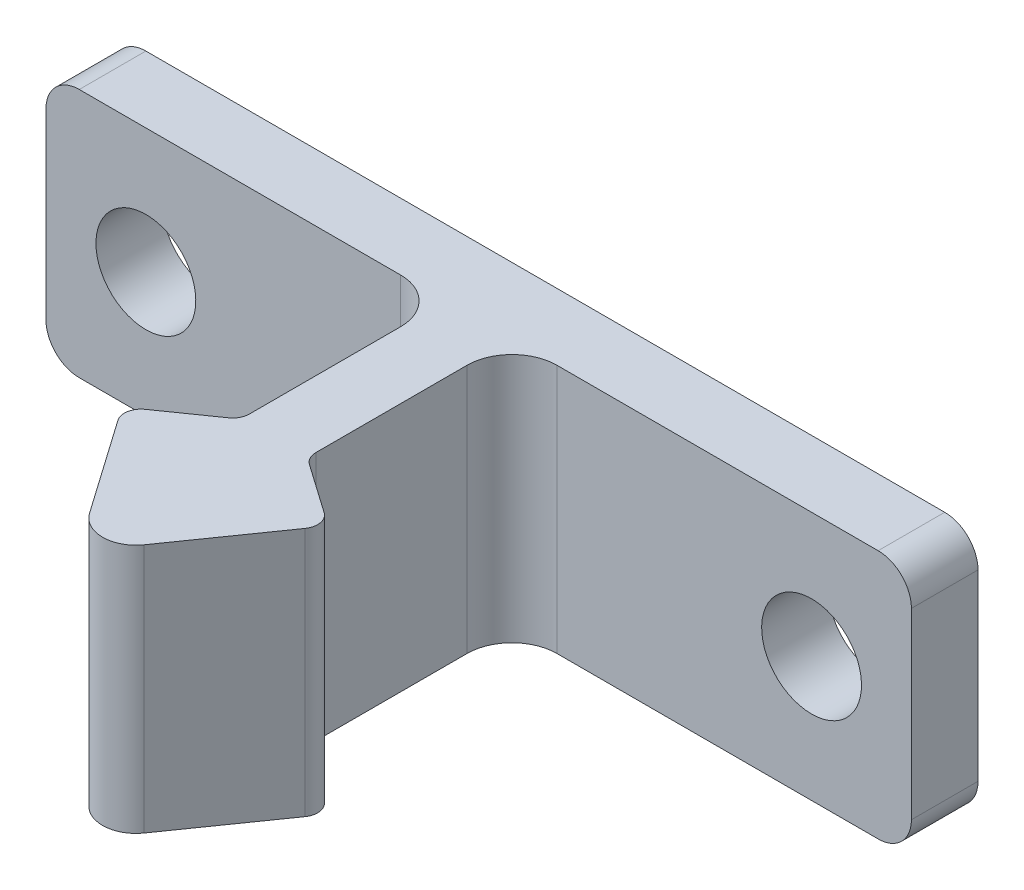
ISO-10303-21;
HEADER;
FILE_DESCRIPTION(('STEP AP214'),'2;1');
FILE_NAME('part.step','',(''),(''),'','','');
FILE_SCHEMA(('AUTOMOTIVE_DESIGN { 1 0 10303 214 1 1 1 1 }'));
ENDSEC;
DATA;
#1=APPLICATION_CONTEXT('core data for automotive mechanical design processes');
#2=APPLICATION_PROTOCOL_DEFINITION('international standard','automotive_design',2000,#1);
#3=PRODUCT_CONTEXT('',#1,'mechanical');
#4=PRODUCT('Part','Part','',(#3));
#5=PRODUCT_RELATED_PRODUCT_CATEGORY('part','',(#4));
#6=PRODUCT_DEFINITION_FORMATION('','',#4);
#7=PRODUCT_DEFINITION_CONTEXT('part definition',#1,'design');
#8=PRODUCT_DEFINITION('design','',#6,#7);
#9=PRODUCT_DEFINITION_SHAPE('','',#8);
#10=(LENGTH_UNIT() NAMED_UNIT(*) SI_UNIT(.MILLI.,.METRE.));
#11=(NAMED_UNIT(*) PLANE_ANGLE_UNIT() SI_UNIT($,.RADIAN.));
#12=(NAMED_UNIT(*) SI_UNIT($,.STERADIAN.) SOLID_ANGLE_UNIT());
#13=UNCERTAINTY_MEASURE_WITH_UNIT(LENGTH_MEASURE(1.E-05),#10,'distance_accuracy_value','');
#14=(GEOMETRIC_REPRESENTATION_CONTEXT(3) GLOBAL_UNCERTAINTY_ASSIGNED_CONTEXT((#13)) GLOBAL_UNIT_ASSIGNED_CONTEXT((#10,
#11,#12)) REPRESENTATION_CONTEXT('',''));
#15=CARTESIAN_POINT('',(0.,0.,0.));
#16=DIRECTION('',(0.,0.,1.));
#17=DIRECTION('',(1.,0.,0.));
#18=AXIS2_PLACEMENT_3D('',#15,#16,#17);
#19=CARTESIAN_POINT('',(1.5,-3.75,-6.153730321));
#20=DIRECTION('',(0.,1.,0.));
#21=DIRECTION('',(-1.,0.,0.));
#22=AXIS2_PLACEMENT_3D('',#19,#20,#21);
#23=CYLINDRICAL_SURFACE('',#22,0.5);
#24=CARTESIAN_POINT('',(1.5,-3.75,-6.153730321));
#25=DIRECTION('',(0.,1.,0.));
#26=DIRECTION('',(-1.,0.,0.));
#27=AXIS2_PLACEMENT_3D('',#24,#25,#26);
#28=CIRCLE('',#27,0.5);
#29=CARTESIAN_POINT('',(1.21321178183325,-3.75,-5.74415430117127));
#30=VERTEX_POINT('',#29);
#31=CARTESIAN_POINT('',(1.000000004,-3.75,-6.153730321));
#32=VERTEX_POINT('',#31);
#33=EDGE_CURVE('E305',#30,#32,#28,.F.);
#34=ORIENTED_EDGE('',*,*,#33,.T.);
#35=DIRECTION('',(0.,1.,0.));
#36=VECTOR('',#35,1.);
#37=CARTESIAN_POINT('',(1.,0.,-6.153730321));
#38=LINE('',#37,#36);
#39=CARTESIAN_POINT('',(1.000000004,3.75,-6.153730321));
#40=VERTEX_POINT('',#39);
#41=EDGE_CURVE('E222',#32,#40,#38,.T.);
#42=ORIENTED_EDGE('',*,*,#41,.T.);
#43=CARTESIAN_POINT('',(1.5,3.75,-6.153730321));
#44=DIRECTION('',(0.,1.,0.));
#45=DIRECTION('',(-1.,0.,0.));
#46=AXIS2_PLACEMENT_3D('',#43,#44,#45);
#47=CIRCLE('',#46,0.5);
#48=CARTESIAN_POINT('',(1.21321178194354,3.75,-5.74415429903953));
#49=VERTEX_POINT('',#48);
#50=EDGE_CURVE('E21',#40,#49,#47,.T.);
#51=ORIENTED_EDGE('',*,*,#50,.T.);
#52=DIRECTION('',(0.,-1.,0.));
#53=VECTOR('',#52,1.);
#54=CARTESIAN_POINT('',(1.213211782,0.,-5.744154299));
#55=LINE('',#54,#53);
#56=EDGE_CURVE('E219',#49,#30,#55,.T.);
#57=ORIENTED_EDGE('',*,*,#56,.T.);
#58=EDGE_LOOP('',(#34,#42,#51,#57));
#59=FACE_BOUND('',#58,.T.);
#60=ADVANCED_FACE('F17',(#59),#23,.F.);
#61=CARTESIAN_POINT('',(2.40163992,3.75,-4.301620663));
#62=DIRECTION('',(0.,-1.,0.));
#63=DIRECTION('',(1.,0.,0.));
#64=AXIS2_PLACEMENT_3D('',#61,#62,#63);
#65=CYLINDRICAL_SURFACE('',#64,0.5);
#66=DIRECTION('',(0.,-1.,0.));
#67=VECTOR('',#66,1.);
#68=CARTESIAN_POINT('',(2.811215943,0.,-4.014832445));
#69=LINE('',#68,#67);
#70=CARTESIAN_POINT('',(2.81121594280241,3.75,-4.01483244471782));
#71=VERTEX_POINT('',#70);
#72=CARTESIAN_POINT('',(2.81121594380688,-3.75,-4.01483244312068));
#73=VERTEX_POINT('',#72);
#74=EDGE_CURVE('E215',#71,#73,#69,.T.);
#75=ORIENTED_EDGE('',*,*,#74,.T.);
#76=CARTESIAN_POINT('',(2.40163992,-3.75,-4.301620663));
#77=DIRECTION('',(0.,-1.,0.));
#78=DIRECTION('',(1.,0.,0.));
#79=AXIS2_PLACEMENT_3D('',#76,#77,#78);
#80=CIRCLE('',#79,0.5);
#81=CARTESIAN_POINT('',(2.68842813804918,-3.75,-4.71119668194676));
#82=VERTEX_POINT('',#81);
#83=EDGE_CURVE('E304',#82,#73,#80,.T.);
#84=ORIENTED_EDGE('',*,*,#83,.F.);
#85=DIRECTION('',(0.,1.,0.));
#86=VECTOR('',#85,1.);
#87=CARTESIAN_POINT('',(2.688428139,0.,-4.711196685));
#88=LINE('',#87,#86);
#89=CARTESIAN_POINT('',(2.68842813872095,3.75,-4.71119668519539));
#90=VERTEX_POINT('',#89);
#91=EDGE_CURVE('E218',#82,#90,#88,.T.);
#92=ORIENTED_EDGE('',*,*,#91,.T.);
#93=CARTESIAN_POINT('',(2.40163992,3.75,-4.301620663));
#94=DIRECTION('',(0.,-1.,0.));
#95=DIRECTION('',(1.,0.,0.));
#96=AXIS2_PLACEMENT_3D('',#93,#94,#95);
#97=CIRCLE('',#96,0.5);
#98=EDGE_CURVE('E302',#71,#90,#97,.F.);
#99=ORIENTED_EDGE('',*,*,#98,.F.);
#100=EDGE_LOOP('',(#75,#84,#92,#99));
#101=FACE_BOUND('',#100,.T.);
#102=ADVANCED_FACE('F319',(#101),#65,.T.);
#103=CARTESIAN_POINT('',(-2.40163992,3.75,-4.301620663));
#104=DIRECTION('',(0.,-1.,0.));
#105=DIRECTION('',(1.,0.,0.));
#106=AXIS2_PLACEMENT_3D('',#103,#104,#105);
#107=CYLINDRICAL_SURFACE('',#106,0.5);
#108=DIRECTION('',(0.,-1.,0.));
#109=VECTOR('',#108,1.);
#110=CARTESIAN_POINT('',(-2.688428139,0.,-4.711196685));
#111=LINE('',#110,#109);
#112=CARTESIAN_POINT('',(-2.68842813872095,3.75,-4.71119668519539));
#113=VERTEX_POINT('',#112);
#114=CARTESIAN_POINT('',(-2.68842813804918,-3.75,-4.71119668194676));
#115=VERTEX_POINT('',#114);
#116=EDGE_CURVE('E200',#113,#115,#111,.T.);
#117=ORIENTED_EDGE('',*,*,#116,.T.);
#118=CARTESIAN_POINT('',(-2.40163992,-3.75,-4.301620663));
#119=DIRECTION('',(0.,-1.,0.));
#120=DIRECTION('',(1.,0.,0.));
#121=AXIS2_PLACEMENT_3D('',#118,#119,#120);
#122=CIRCLE('',#121,0.5);
#123=CARTESIAN_POINT('',(-2.81121594380688,-3.75,-4.01483244312068));
#124=VERTEX_POINT('',#123);
#125=EDGE_CURVE('E300',#124,#115,#122,.T.);
#126=ORIENTED_EDGE('',*,*,#125,.F.);
#127=DIRECTION('',(0.,1.,0.));
#128=VECTOR('',#127,1.);
#129=CARTESIAN_POINT('',(-2.811215943,0.,-4.014832445));
#130=LINE('',#129,#128);
#131=CARTESIAN_POINT('',(-2.81121594280241,3.75,-4.01483244471782));
#132=VERTEX_POINT('',#131);
#133=EDGE_CURVE('E206',#124,#132,#130,.T.);
#134=ORIENTED_EDGE('',*,*,#133,.T.);
#135=CARTESIAN_POINT('',(-2.40163992,3.75,-4.301620663));
#136=DIRECTION('',(0.,-1.,0.));
#137=DIRECTION('',(1.,0.,0.));
#138=AXIS2_PLACEMENT_3D('',#135,#136,#137);
#139=CIRCLE('',#138,0.5);
#140=EDGE_CURVE('E298',#113,#132,#139,.F.);
#141=ORIENTED_EDGE('',*,*,#140,.F.);
#142=EDGE_LOOP('',(#117,#126,#134,#141));
#143=FACE_BOUND('',#142,.T.);
#144=ADVANCED_FACE('F420',(#143),#107,.T.);
#145=CARTESIAN_POINT('',(-1.5,-3.75,-6.153730321));
#146=DIRECTION('',(0.,1.,0.));
#147=DIRECTION('',(-1.,0.,0.));
#148=AXIS2_PLACEMENT_3D('',#145,#146,#147);
#149=CYLINDRICAL_SURFACE('',#148,0.5);
#150=CARTESIAN_POINT('',(-1.5,-3.75,-6.153730321));
#151=DIRECTION('',(0.,1.,0.));
#152=DIRECTION('',(-1.,0.,0.));
#153=AXIS2_PLACEMENT_3D('',#150,#151,#152);
#154=CIRCLE('',#153,0.5);
#155=CARTESIAN_POINT('',(-1.000000004,-3.75,-6.153730321));
#156=VERTEX_POINT('',#155);
#157=CARTESIAN_POINT('',(-1.21321178183325,-3.75,-5.74415430117127));
#158=VERTEX_POINT('',#157);
#159=EDGE_CURVE('E294',#156,#158,#154,.F.);
#160=ORIENTED_EDGE('',*,*,#159,.T.);
#161=DIRECTION('',(0.,1.,0.));
#162=VECTOR('',#161,1.);
#163=CARTESIAN_POINT('',(-1.213211782,0.,-5.744154299));
#164=LINE('',#163,#162);
#165=CARTESIAN_POINT('',(-1.21321178194354,3.75,-5.74415429903953));
#166=VERTEX_POINT('',#165);
#167=EDGE_CURVE('E203',#158,#166,#164,.T.);
#168=ORIENTED_EDGE('',*,*,#167,.T.);
#169=CARTESIAN_POINT('',(-1.5,3.75,-6.153730321));
#170=DIRECTION('',(0.,1.,0.));
#171=DIRECTION('',(-1.,0.,0.));
#172=AXIS2_PLACEMENT_3D('',#169,#170,#171);
#173=CIRCLE('',#172,0.5);
#174=CARTESIAN_POINT('',(-1.000000004,3.75,-6.153730321));
#175=VERTEX_POINT('',#174);
#176=EDGE_CURVE('E296',#166,#175,#173,.T.);
#177=ORIENTED_EDGE('',*,*,#176,.T.);
#178=DIRECTION('',(0.,-1.,0.));
#179=VECTOR('',#178,1.);
#180=CARTESIAN_POINT('',(-1.,0.,-6.153730321));
#181=LINE('',#180,#179);
#182=EDGE_CURVE('E197',#175,#156,#181,.T.);
#183=ORIENTED_EDGE('',*,*,#182,.T.);
#184=EDGE_LOOP('',(#160,#168,#177,#183));
#185=FACE_BOUND('',#184,.T.);
#186=ADVANCED_FACE('F414',(#185),#149,.F.);
#187=CARTESIAN_POINT('',(-12.,2.75,-14.043446796));
#188=DIRECTION('',(0.,0.,1.));
#189=DIRECTION('',(0.,-1.,0.));
#190=AXIS2_PLACEMENT_3D('',#187,#188,#189);
#191=CYLINDRICAL_SURFACE('',#190,1.);
#192=DIRECTION('',(0.,0.,1.));
#193=VECTOR('',#192,1.);
#194=CARTESIAN_POINT('',(-13.,2.75,-13.043446796));
#195=LINE('',#194,#193);
#196=CARTESIAN_POINT('',(-13.,2.75,-14.043446796));
#197=VERTEX_POINT('',#196);
#198=CARTESIAN_POINT('',(-13.,2.75,-12.043446796));
#199=VERTEX_POINT('',#198);
#200=EDGE_CURVE('E173',#197,#199,#195,.T.);
#201=ORIENTED_EDGE('',*,*,#200,.T.);
#202=CARTESIAN_POINT('',(-12.,2.75,-12.043446796));
#203=DIRECTION('',(0.,0.,1.));
#204=DIRECTION('',(0.,-1.,0.));
#205=AXIS2_PLACEMENT_3D('',#202,#203,#204);
#206=CIRCLE('',#205,1.);
#207=CARTESIAN_POINT('',(-12.,3.75,-12.0434467990565));
#208=VERTEX_POINT('',#207);
#209=EDGE_CURVE('E153',#199,#208,#206,.F.);
#210=ORIENTED_EDGE('',*,*,#209,.T.);
#211=DIRECTION('',(0.,0.,-1.));
#212=VECTOR('',#211,1.);
#213=CARTESIAN_POINT('',(-12.,3.75,-7.353546796));
#214=LINE('',#213,#212);
#215=CARTESIAN_POINT('',(-12.,3.75,-14.043446796));
#216=VERTEX_POINT('',#215);
#217=EDGE_CURVE('E190',#208,#216,#214,.T.);
#218=ORIENTED_EDGE('',*,*,#217,.T.);
#219=CARTESIAN_POINT('',(-12.,2.75,-14.043446796));
#220=DIRECTION('',(0.,0.,1.));
#221=DIRECTION('',(0.,-1.,0.));
#222=AXIS2_PLACEMENT_3D('',#219,#220,#221);
#223=CIRCLE('',#222,1.);
#224=EDGE_CURVE('E179',#197,#216,#223,.F.);
#225=ORIENTED_EDGE('',*,*,#224,.F.);
#226=EDGE_LOOP('',(#201,#210,#218,#225));
#227=FACE_BOUND('',#226,.T.);
#228=ADVANCED_FACE('F178',(#227),#191,.T.);
#229=CARTESIAN_POINT('',(12.,2.75,-12.043446796));
#230=DIRECTION('',(0.,0.,-1.));
#231=DIRECTION('',(0.,1.,0.));
#232=AXIS2_PLACEMENT_3D('',#229,#230,#231);
#233=CYLINDRICAL_SURFACE('',#232,1.);
#234=DIRECTION('',(0.,0.,-1.));
#235=VECTOR('',#234,1.);
#236=CARTESIAN_POINT('',(13.,2.75,-13.043446796));
#237=LINE('',#236,#235);
#238=CARTESIAN_POINT('',(13.,2.75,-12.043446796));
#239=VERTEX_POINT('',#238);
#240=CARTESIAN_POINT('',(13.,2.75,-14.043446796));
#241=VERTEX_POINT('',#240);
#242=EDGE_CURVE('E334',#239,#241,#237,.T.);
#243=ORIENTED_EDGE('',*,*,#242,.T.);
#244=CARTESIAN_POINT('',(12.,2.75,-14.043446796));
#245=DIRECTION('',(0.,0.,-1.));
#246=DIRECTION('',(0.,1.,0.));
#247=AXIS2_PLACEMENT_3D('',#244,#245,#246);
#248=CIRCLE('',#247,1.);
#249=CARTESIAN_POINT('',(12.,3.75,-14.043446796));
#250=VERTEX_POINT('',#249);
#251=EDGE_CURVE('E291',#250,#241,#248,.T.);
#252=ORIENTED_EDGE('',*,*,#251,.F.);
#253=DIRECTION('',(0.,0.,1.));
#254=VECTOR('',#253,1.);
#255=CARTESIAN_POINT('',(12.,3.75,-7.353546796));
#256=LINE('',#255,#254);
#257=CARTESIAN_POINT('',(12.,3.75,-12.043446796));
#258=VERTEX_POINT('',#257);
#259=EDGE_CURVE('E192',#250,#258,#256,.T.);
#260=ORIENTED_EDGE('',*,*,#259,.T.);
#261=CARTESIAN_POINT('',(12.,2.75,-12.043446796));
#262=DIRECTION('',(0.,0.,-1.));
#263=DIRECTION('',(0.,1.,0.));
#264=AXIS2_PLACEMENT_3D('',#261,#262,#263);
#265=CIRCLE('',#264,1.);
#266=EDGE_CURVE('E289',#239,#258,#265,.F.);
#267=ORIENTED_EDGE('',*,*,#266,.F.);
#268=EDGE_LOOP('',(#243,#252,#260,#267));
#269=FACE_BOUND('',#268,.T.);
#270=ADVANCED_FACE('F344',(#269),#233,.T.);
#271=CARTESIAN_POINT('',(12.,-2.75,-14.043446796));
#272=DIRECTION('',(0.,0.,1.));
#273=DIRECTION('',(0.,-1.,0.));
#274=AXIS2_PLACEMENT_3D('',#271,#272,#273);
#275=CYLINDRICAL_SURFACE('',#274,1.);
#276=DIRECTION('',(0.,0.,1.));
#277=VECTOR('',#276,1.);
#278=CARTESIAN_POINT('',(12.,-3.75,-7.353546796));
#279=LINE('',#278,#277);
#280=CARTESIAN_POINT('',(12.,-3.75,-14.043446796));
#281=VERTEX_POINT('',#280);
#282=CARTESIAN_POINT('',(12.,-3.75,-12.043446796));
#283=VERTEX_POINT('',#282);
#284=EDGE_CURVE('E260',#281,#283,#279,.T.);
#285=ORIENTED_EDGE('',*,*,#284,.F.);
#286=CARTESIAN_POINT('',(12.,-2.75,-14.043446796));
#287=DIRECTION('',(0.,0.,1.));
#288=DIRECTION('',(0.,-1.,0.));
#289=AXIS2_PLACEMENT_3D('',#286,#287,#288);
#290=CIRCLE('',#289,1.);
#291=CARTESIAN_POINT('',(13.,-2.75,-14.043446796));
#292=VERTEX_POINT('',#291);
#293=EDGE_CURVE('E287',#292,#281,#290,.F.);
#294=ORIENTED_EDGE('',*,*,#293,.F.);
#295=DIRECTION('',(0.,0.,1.));
#296=VECTOR('',#295,1.);
#297=CARTESIAN_POINT('',(13.,-2.75,-13.043446796));
#298=LINE('',#297,#296);
#299=CARTESIAN_POINT('',(13.,-2.75,-12.043446796));
#300=VERTEX_POINT('',#299);
#301=EDGE_CURVE('E330',#292,#300,#298,.T.);
#302=ORIENTED_EDGE('',*,*,#301,.T.);
#303=CARTESIAN_POINT('',(12.,-2.75,-12.043446796));
#304=DIRECTION('',(0.,0.,1.));
#305=DIRECTION('',(0.,-1.,0.));
#306=AXIS2_PLACEMENT_3D('',#303,#304,#305);
#307=CIRCLE('',#306,1.);
#308=EDGE_CURVE('E36',#283,#300,#307,.T.);
#309=ORIENTED_EDGE('',*,*,#308,.F.);
#310=EDGE_LOOP('',(#285,#294,#302,#309));
#311=FACE_BOUND('',#310,.T.);
#312=ADVANCED_FACE('F375',(#311),#275,.T.);
#313=CARTESIAN_POINT('',(1.,-3.75,-10.693446796));
#314=DIRECTION('',(-1.,0.,0.));
#315=DIRECTION('',(0.,0.,1.));
#316=AXIS2_PLACEMENT_3D('',#313,#314,#315);
#317=PLANE('',#316);
#318=ORIENTED_EDGE('',*,*,#41,.F.);
#319=DIRECTION('',(0.,0.,1.));
#320=VECTOR('',#319,1.);
#321=CARTESIAN_POINT('',(1.000000008,-3.75,-7.353546796));
#322=LINE('',#321,#320);
#323=CARTESIAN_POINT('',(1.000000004,-3.75,-10.6934467962597));
#324=VERTEX_POINT('',#323);
#325=EDGE_CURVE('E256',#324,#32,#322,.T.);
#326=ORIENTED_EDGE('',*,*,#325,.F.);
#327=DIRECTION('',(0.,1.,0.));
#328=VECTOR('',#327,1.);
#329=CARTESIAN_POINT('',(0.999999999999999,0.,-10.6934467965193));
#330=LINE('',#329,#328);
#331=CARTESIAN_POINT('',(1.000000004,3.75,-10.6934467962597));
#332=VERTEX_POINT('',#331);
#333=EDGE_CURVE('E135',#332,#324,#330,.F.);
#334=ORIENTED_EDGE('',*,*,#333,.F.);
#335=DIRECTION('',(0.,0.,1.));
#336=VECTOR('',#335,1.);
#337=CARTESIAN_POINT('',(1.000000008,3.75,-7.353546796));
#338=LINE('',#337,#336);
#339=EDGE_CURVE('E280',#332,#40,#338,.T.);
#340=ORIENTED_EDGE('',*,*,#339,.T.);
#341=EDGE_LOOP('',(#318,#326,#334,#340));
#342=FACE_BOUND('',#341,.T.);
#343=ADVANCED_FACE('F457',(#342),#317,.F.);
#344=CARTESIAN_POINT('',(1.213211782,-3.75,-5.744154299));
#345=DIRECTION('',(-0.573576436477107,0.,0.819152044200723));
#346=DIRECTION('',(0.819152044200723,0.,0.573576436477107));
#347=AXIS2_PLACEMENT_3D('',#344,#345,#346);
#348=PLANE('',#347);
#349=ORIENTED_EDGE('',*,*,#91,.F.);
#350=DIRECTION('',(0.819152041188166,0.,0.573576440779484));
#351=VECTOR('',#350,1.);
#352=CARTESIAN_POINT('',(1.213211784,-3.75,-5.7441543017086));
#353=LINE('',#352,#351);
#354=EDGE_CURVE('E253',#30,#82,#353,.T.);
#355=ORIENTED_EDGE('',*,*,#354,.F.);
#356=ORIENTED_EDGE('',*,*,#56,.F.);
#357=DIRECTION('',(0.819152044200723,0.,0.573576436477107));
#358=VECTOR('',#357,1.);
#359=CARTESIAN_POINT('',(1.213211782,3.75,-5.744154299));
#360=LINE('',#359,#358);
#361=EDGE_CURVE('E277',#49,#90,#360,.T.);
#362=ORIENTED_EDGE('',*,*,#361,.T.);
#363=EDGE_LOOP('',(#349,#355,#356,#362));
#364=FACE_BOUND('',#363,.T.);
#365=ADVANCED_FACE('F312',(#364),#348,.F.);
#366=CARTESIAN_POINT('',(2.811215943,-3.75,-4.014832445));
#367=DIRECTION('',(-0.819152044226494,0.,-0.573576436440302));
#368=DIRECTION('',(-0.573576436440302,0.,0.819152044226494));
#369=AXIS2_PLACEMENT_3D('',#366,#367,#368);
#370=PLANE('',#369);
#371=ORIENTED_EDGE('',*,*,#74,.F.);
#372=DIRECTION('',(-0.573576436440302,0.,0.819152044226494));
#373=VECTOR('',#372,1.);
#374=CARTESIAN_POINT('',(2.811215943,3.75,-4.014832445));
#375=LINE('',#374,#373);
#376=CARTESIAN_POINT('',(0.819152044311206,3.75,-1.16987035956256));
#377=VERTEX_POINT('',#376);
#378=EDGE_CURVE('E274',#71,#377,#375,.T.);
#379=ORIENTED_EDGE('',*,*,#378,.T.);
#380=DIRECTION('',(0.,1.,0.));
#381=VECTOR('',#380,1.);
#382=CARTESIAN_POINT('',(0.819152044284927,0.,-1.16987035964315));
#383=LINE('',#382,#381);
#384=CARTESIAN_POINT('',(0.819152040729748,-3.75,-1.16987036028271));
#385=VERTEX_POINT('',#384);
#386=EDGE_CURVE('E210',#377,#385,#383,.F.);
#387=ORIENTED_EDGE('',*,*,#386,.T.);
#388=DIRECTION('',(-0.573576438839323,0.,0.819152042546681));
#389=VECTOR('',#388,1.);
#390=CARTESIAN_POINT('',(2.811215952,-3.75,-4.01483245179));
#391=LINE('',#390,#389);
#392=EDGE_CURVE('E250',#73,#385,#391,.T.);
#393=ORIENTED_EDGE('',*,*,#392,.F.);
#394=EDGE_LOOP('',(#371,#379,#387,#393));
#395=FACE_BOUND('',#394,.T.);
#396=ADVANCED_FACE('F395',(#395),#370,.F.);
#397=CARTESIAN_POINT('',(0.,3.75,-1.743446796));
#398=DIRECTION('',(0.,-1.,0.));
#399=DIRECTION('',(1.,0.,0.));
#400=AXIS2_PLACEMENT_3D('',#397,#398,#399);
#401=CYLINDRICAL_SURFACE('',#400,1.);
#402=ORIENTED_EDGE('',*,*,#386,.F.);
#403=CARTESIAN_POINT('',(0.,3.75,-1.743446796));
#404=DIRECTION('',(0.,-1.,0.));
#405=DIRECTION('',(1.,0.,0.));
#406=AXIS2_PLACEMENT_3D('',#403,#404,#405);
#407=CIRCLE('',#406,1.);
#408=CARTESIAN_POINT('',(-0.819152044168743,3.75,-1.16987035924099));
#409=VERTEX_POINT('',#408);
#410=EDGE_CURVE('E271',#377,#409,#407,.T.);
#411=ORIENTED_EDGE('',*,*,#410,.T.);
#412=DIRECTION('',(0.,-1.,0.));
#413=VECTOR('',#412,1.);
#414=CARTESIAN_POINT('',(-0.819152044,0.,-1.169870359));
#415=LINE('',#414,#413);
#416=CARTESIAN_POINT('',(-0.819152040587284,-3.75,-1.16987035996114));
#417=VERTEX_POINT('',#416);
#418=EDGE_CURVE('E207',#409,#417,#415,.T.);
#419=ORIENTED_EDGE('',*,*,#418,.T.);
#420=CARTESIAN_POINT('',(0.,-3.75,-1.743446796));
#421=DIRECTION('',(0.,-1.,0.));
#422=DIRECTION('',(1.,0.,0.));
#423=AXIS2_PLACEMENT_3D('',#420,#421,#422);
#424=CIRCLE('',#423,1.);
#425=EDGE_CURVE('E247',#385,#417,#424,.T.);
#426=ORIENTED_EDGE('',*,*,#425,.F.);
#427=EDGE_LOOP('',(#402,#411,#419,#426));
#428=FACE_BOUND('',#427,.T.);
#429=ADVANCED_FACE('F391',(#428),#401,.T.);
#430=CARTESIAN_POINT('',(-0.819152044,-3.75,-1.169870359));
#431=DIRECTION('',(0.819152044226494,0.,-0.573576436440302));
#432=DIRECTION('',(-0.573576436440302,0.,-0.819152044226494));
#433=AXIS2_PLACEMENT_3D('',#430,#431,#432);
#434=PLANE('',#433);
#435=ORIENTED_EDGE('',*,*,#133,.F.);
#436=DIRECTION('',(-0.573576438839324,0.,-0.819152042546681));
#437=VECTOR('',#436,1.);
#438=CARTESIAN_POINT('',(-0.819152039999996,-3.75,-1.1698703649574));
#439=LINE('',#438,#437);
#440=EDGE_CURVE('E244',#417,#124,#439,.T.);
#441=ORIENTED_EDGE('',*,*,#440,.F.);
#442=ORIENTED_EDGE('',*,*,#418,.F.);
#443=DIRECTION('',(-0.573576436440302,0.,-0.819152044226494));
#444=VECTOR('',#443,1.);
#445=CARTESIAN_POINT('',(-0.819152044,3.75,-1.169870359));
#446=LINE('',#445,#444);
#447=EDGE_CURVE('E268',#409,#132,#446,.T.);
#448=ORIENTED_EDGE('',*,*,#447,.T.);
#449=EDGE_LOOP('',(#435,#441,#442,#448));
#450=FACE_BOUND('',#449,.T.);
#451=ADVANCED_FACE('F424',(#450),#434,.F.);
#452=CARTESIAN_POINT('',(-2.688428139,-3.75,-4.711196685));
#453=DIRECTION('',(0.573576436477107,0.,0.819152044200723));
#454=DIRECTION('',(0.819152044200723,0.,-0.573576436477107));
#455=AXIS2_PLACEMENT_3D('',#452,#453,#454);
#456=PLANE('',#455);
#457=ORIENTED_EDGE('',*,*,#116,.F.);
#458=DIRECTION('',(0.819152044200723,0.,-0.573576436477107));
#459=VECTOR('',#458,1.);
#460=CARTESIAN_POINT('',(-2.688428139,3.75,-4.711196685));
#461=LINE('',#460,#459);
#462=EDGE_CURVE('E265',#113,#166,#461,.T.);
#463=ORIENTED_EDGE('',*,*,#462,.T.);
#464=ORIENTED_EDGE('',*,*,#167,.F.);
#465=DIRECTION('',(0.819152041188165,0.,-0.573576440779485));
#466=VECTOR('',#465,1.);
#467=CARTESIAN_POINT('',(-2.688428136,-3.75,-4.7111966796626));
#468=LINE('',#467,#466);
#469=EDGE_CURVE('E241',#115,#158,#468,.T.);
#470=ORIENTED_EDGE('',*,*,#469,.F.);
#471=EDGE_LOOP('',(#457,#463,#464,#470));
#472=FACE_BOUND('',#471,.T.);
#473=ADVANCED_FACE('F418',(#472),#456,.F.);
#474=CARTESIAN_POINT('',(-1.,-3.75,-6.153730321));
#475=DIRECTION('',(1.,0.,0.));
#476=DIRECTION('',(0.,0.,-1.));
#477=AXIS2_PLACEMENT_3D('',#474,#475,#476);
#478=PLANE('',#477);
#479=ORIENTED_EDGE('',*,*,#182,.F.);
#480=DIRECTION('',(0.,0.,-1.));
#481=VECTOR('',#480,1.);
#482=CARTESIAN_POINT('',(-1.000000008,3.75,-7.353546796));
#483=LINE('',#482,#481);
#484=CARTESIAN_POINT('',(-1.000000004,3.75,-10.6934467961384));
#485=VERTEX_POINT('',#484);
#486=EDGE_CURVE('E264',#175,#485,#483,.T.);
#487=ORIENTED_EDGE('',*,*,#486,.T.);
#488=DIRECTION('',(0.,-1.,0.));
#489=VECTOR('',#488,1.);
#490=CARTESIAN_POINT('',(-0.999999999999999,0.,-10.6934467962769));
#491=LINE('',#490,#489);
#492=CARTESIAN_POINT('',(-1.000000004,-3.75,-10.6934467961384));
#493=VERTEX_POINT('',#492);
#494=EDGE_CURVE('E166',#493,#485,#491,.F.);
#495=ORIENTED_EDGE('',*,*,#494,.F.);
#496=DIRECTION('',(0.,0.,-1.));
#497=VECTOR('',#496,1.);
#498=CARTESIAN_POINT('',(-1.000000008,-3.75,-7.353546796));
#499=LINE('',#498,#497);
#500=EDGE_CURVE('E240',#156,#493,#499,.T.);
#501=ORIENTED_EDGE('',*,*,#500,.F.);
#502=EDGE_LOOP('',(#479,#487,#495,#501));
#503=FACE_BOUND('',#502,.T.);
#504=ADVANCED_FACE('F405',(#503),#478,.F.);
#505=CARTESIAN_POINT('',(-2.35,-3.75,-10.693446796));
#506=DIRECTION('',(0.,1.,0.));
#507=DIRECTION('',(-1.,0.,0.));
#508=AXIS2_PLACEMENT_3D('',#505,#506,#507);
#509=CYLINDRICAL_SURFACE('',#508,1.35);
#510=CARTESIAN_POINT('',(-2.35,-3.75,-10.693446796));
#511=DIRECTION('',(0.,1.,0.));
#512=DIRECTION('',(-1.,0.,0.));
#513=AXIS2_PLACEMENT_3D('',#510,#511,#512);
#514=CIRCLE('',#513,1.35);
#515=CARTESIAN_POINT('',(-2.35,-3.75,-12.0434467990565));
#516=VERTEX_POINT('',#515);
#517=EDGE_CURVE('E236',#493,#516,#514,.T.);
#518=ORIENTED_EDGE('',*,*,#517,.F.);
#519=ORIENTED_EDGE('',*,*,#494,.T.);
#520=CARTESIAN_POINT('',(-2.35,3.75,-10.693446796));
#521=DIRECTION('',(0.,1.,0.));
#522=DIRECTION('',(-1.,0.,0.));
#523=AXIS2_PLACEMENT_3D('',#520,#521,#522);
#524=CIRCLE('',#523,1.35);
#525=CARTESIAN_POINT('',(-2.35,3.75,-12.0434467990565));
#526=VERTEX_POINT('',#525);
#527=EDGE_CURVE('E261',#485,#526,#524,.T.);
#528=ORIENTED_EDGE('',*,*,#527,.T.);
#529=DIRECTION('',(0.,-1.,0.));
#530=VECTOR('',#529,1.);
#531=CARTESIAN_POINT('',(-2.35,0.,-12.043446796));
#532=LINE('',#531,#530);
#533=EDGE_CURVE('E165',#526,#516,#532,.T.);
#534=ORIENTED_EDGE('',*,*,#533,.T.);
#535=EDGE_LOOP('',(#518,#519,#528,#534));
#536=FACE_BOUND('',#535,.T.);
#537=ADVANCED_FACE('F409',(#536),#509,.F.);
#538=CARTESIAN_POINT('',(-2.35,-3.75,-12.043446796));
#539=DIRECTION('',(0.,0.,-1.));
#540=DIRECTION('',(-1.,0.,0.));
#541=AXIS2_PLACEMENT_3D('',#538,#539,#540);
#542=PLANE('',#541);
#543=CARTESIAN_POINT('',(-10.,0.,-12.043446796));
#544=DIRECTION('',(0.,0.,1.));
#545=DIRECTION('',(0.,-1.,0.));
#546=AXIS2_PLACEMENT_3D('',#543,#544,#545);
#547=CIRCLE('',#546,1.5);
#548=CARTESIAN_POINT('',(-10.,-1.5,-12.043446796));
#549=VERTEX_POINT('',#548);
#550=EDGE_CURVE('E189',#549,#549,#547,.T.);
#551=ORIENTED_EDGE('',*,*,#550,.F.);
#552=EDGE_LOOP('',(#551));
#553=FACE_BOUND('',#552,.T.);
#554=CARTESIAN_POINT('',(-12.,-2.75,-12.043446796));
#555=DIRECTION('',(0.,0.,-1.));
#556=DIRECTION('',(0.,1.,0.));
#557=AXIS2_PLACEMENT_3D('',#554,#555,#556);
#558=CIRCLE('',#557,1.);
#559=CARTESIAN_POINT('',(-13.,-2.75,-12.043446796));
#560=VERTEX_POINT('',#559);
#561=CARTESIAN_POINT('',(-12.,-3.75,-12.0434467990565));
#562=VERTEX_POINT('',#561);
#563=EDGE_CURVE('E182',#560,#562,#558,.F.);
#564=ORIENTED_EDGE('',*,*,#563,.T.);
#565=DIRECTION('',(-1.,0.,0.));
#566=VECTOR('',#565,1.);
#567=CARTESIAN_POINT('',(0.,-3.75,-12.043446802113));
#568=LINE('',#567,#566);
#569=EDGE_CURVE('E239',#516,#562,#568,.T.);
#570=ORIENTED_EDGE('',*,*,#569,.F.);
#571=ORIENTED_EDGE('',*,*,#533,.F.);
#572=DIRECTION('',(-1.,0.,0.));
#573=VECTOR('',#572,1.);
#574=CARTESIAN_POINT('',(0.,3.75,-12.043446802113));
#575=LINE('',#574,#573);
#576=EDGE_CURVE('E160',#526,#208,#575,.T.);
#577=ORIENTED_EDGE('',*,*,#576,.T.);
#578=ORIENTED_EDGE('',*,*,#209,.F.);
#579=DIRECTION('',(0.,-1.,0.));
#580=VECTOR('',#579,1.);
#581=CARTESIAN_POINT('',(-13.,0.,-12.043446796));
#582=LINE('',#581,#580);
#583=EDGE_CURVE('E157',#199,#560,#582,.T.);
#584=ORIENTED_EDGE('',*,*,#583,.T.);
#585=EDGE_LOOP('',(#564,#570,#571,#577,#578,#584));
#586=FACE_BOUND('',#585,.T.);
#587=ADVANCED_FACE('F156',(#553,#586),#542,.F.);
#588=CARTESIAN_POINT('',(-12.,-2.75,-12.043446796));
#589=DIRECTION('',(0.,0.,-1.));
#590=DIRECTION('',(0.,1.,0.));
#591=AXIS2_PLACEMENT_3D('',#588,#589,#590);
#592=CYLINDRICAL_SURFACE('',#591,1.);
#593=DIRECTION('',(0.,0.,-1.));
#594=VECTOR('',#593,1.);
#595=CARTESIAN_POINT('',(-12.,-3.75,-7.353546796));
#596=LINE('',#595,#594);
#597=CARTESIAN_POINT('',(-12.,-3.75,-14.043446796));
#598=VERTEX_POINT('',#597);
#599=EDGE_CURVE('E186',#562,#598,#596,.T.);
#600=ORIENTED_EDGE('',*,*,#599,.F.);
#601=ORIENTED_EDGE('',*,*,#563,.F.);
#602=DIRECTION('',(0.,0.,-1.));
#603=VECTOR('',#602,1.);
#604=CARTESIAN_POINT('',(-13.,-2.75,-13.043446796));
#605=LINE('',#604,#603);
#606=CARTESIAN_POINT('',(-13.,-2.75,-14.043446796));
#607=VERTEX_POINT('',#606);
#608=EDGE_CURVE('E176',#560,#607,#605,.T.);
#609=ORIENTED_EDGE('',*,*,#608,.T.);
#610=CARTESIAN_POINT('',(-12.,-2.75,-14.043446796));
#611=DIRECTION('',(0.,0.,-1.));
#612=DIRECTION('',(0.,1.,0.));
#613=AXIS2_PLACEMENT_3D('',#610,#611,#612);
#614=CIRCLE('',#613,1.);
#615=EDGE_CURVE('E180',#598,#607,#614,.T.);
#616=ORIENTED_EDGE('',*,*,#615,.F.);
#617=EDGE_LOOP('',(#600,#601,#609,#616));
#618=FACE_BOUND('',#617,.T.);
#619=ADVANCED_FACE('F410',(#618),#592,.T.);
#620=CARTESIAN_POINT('',(-13.,-2.75,-12.043446796));
#621=DIRECTION('',(1.,0.,0.));
#622=DIRECTION('',(0.,0.,-1.));
#623=AXIS2_PLACEMENT_3D('',#620,#621,#622);
#624=PLANE('',#623);
#625=ORIENTED_EDGE('',*,*,#608,.F.);
#626=ORIENTED_EDGE('',*,*,#583,.F.);
#627=ORIENTED_EDGE('',*,*,#200,.F.);
#628=DIRECTION('',(0.,-1.,0.));
#629=VECTOR('',#628,1.);
#630=CARTESIAN_POINT('',(-13.,0.,-14.043446796));
#631=LINE('',#630,#629);
#632=EDGE_CURVE('E363',#197,#607,#631,.T.);
#633=ORIENTED_EDGE('',*,*,#632,.T.);
#634=EDGE_LOOP('',(#625,#626,#627,#633));
#635=FACE_BOUND('',#634,.T.);
#636=ADVANCED_FACE('F171',(#635),#624,.F.);
#637=CARTESIAN_POINT('',(-10.,0.,-14.043446796));
#638=DIRECTION('',(0.,0.,1.));
#639=DIRECTION('',(0.,-1.,0.));
#640=AXIS2_PLACEMENT_3D('',#637,#638,#639);
#641=CYLINDRICAL_SURFACE('',#640,1.5);
#642=CARTESIAN_POINT('',(-10.,0.,-14.043446796));
#643=DIRECTION('',(0.,0.,1.));
#644=DIRECTION('',(0.,-1.,0.));
#645=AXIS2_PLACEMENT_3D('',#642,#643,#644);
#646=CIRCLE('',#645,1.5);
#647=CARTESIAN_POINT('',(-10.,-1.5,-14.043446796));
#648=VERTEX_POINT('',#647);
#649=EDGE_CURVE('E231',#648,#648,#646,.F.);
#650=ORIENTED_EDGE('',*,*,#649,.T.);
#651=EDGE_LOOP('',(#650));
#652=FACE_BOUND('',#651,.T.);
#653=ORIENTED_EDGE('',*,*,#550,.T.);
#654=EDGE_LOOP('',(#653));
#655=FACE_BOUND('',#654,.T.);
#656=ADVANCED_FACE('F447',(#652,#655),#641,.F.);
#657=CARTESIAN_POINT('',(2.35,-3.75,-10.693446796));
#658=DIRECTION('',(0.,1.,0.));
#659=DIRECTION('',(-1.,0.,0.));
#660=AXIS2_PLACEMENT_3D('',#657,#658,#659);
#661=CYLINDRICAL_SURFACE('',#660,1.35);
#662=CARTESIAN_POINT('',(2.35,-3.75,-10.693446796));
#663=DIRECTION('',(0.,1.,0.));
#664=DIRECTION('',(-1.,0.,0.));
#665=AXIS2_PLACEMENT_3D('',#662,#663,#664);
#666=CIRCLE('',#665,1.35);
#667=CARTESIAN_POINT('',(2.35,-3.75,-12.043446796));
#668=VERTEX_POINT('',#667);
#669=EDGE_CURVE('E257',#668,#324,#666,.T.);
#670=ORIENTED_EDGE('',*,*,#669,.F.);
#671=DIRECTION('',(0.,1.,0.));
#672=VECTOR('',#671,1.);
#673=CARTESIAN_POINT('',(2.35,0.,-12.043446796));
#674=LINE('',#673,#672);
#675=CARTESIAN_POINT('',(2.35,3.75,-12.043446796));
#676=VERTEX_POINT('',#675);
#677=EDGE_CURVE('E234',#668,#676,#674,.T.);
#678=ORIENTED_EDGE('',*,*,#677,.T.);
#679=CARTESIAN_POINT('',(2.35,3.75,-10.693446796));
#680=DIRECTION('',(0.,1.,0.));
#681=DIRECTION('',(-1.,0.,0.));
#682=AXIS2_PLACEMENT_3D('',#679,#680,#681);
#683=CIRCLE('',#682,1.35);
#684=EDGE_CURVE('E226',#676,#332,#683,.T.);
#685=ORIENTED_EDGE('',*,*,#684,.T.);
#686=ORIENTED_EDGE('',*,*,#333,.T.);
#687=EDGE_LOOP('',(#670,#678,#685,#686));
#688=FACE_BOUND('',#687,.T.);
#689=ADVANCED_FACE('F380',(#688),#661,.F.);
#690=CARTESIAN_POINT('',(-12.,3.75,-0.663646796));
#691=DIRECTION('',(0.,-1.,0.));
#692=DIRECTION('',(0.,0.,-1.));
#693=AXIS2_PLACEMENT_3D('',#690,#691,#692);
#694=PLANE('',#693);
#695=ORIENTED_EDGE('',*,*,#259,.F.);
#696=DIRECTION('',(-1.,0.,0.));
#697=VECTOR('',#696,1.);
#698=CARTESIAN_POINT('',(0.,3.75,-14.043446796));
#699=LINE('',#698,#697);
#700=EDGE_CURVE('E365',#250,#216,#699,.T.);
#701=ORIENTED_EDGE('',*,*,#700,.T.);
#702=ORIENTED_EDGE('',*,*,#217,.F.);
#703=ORIENTED_EDGE('',*,*,#576,.F.);
#704=ORIENTED_EDGE('',*,*,#527,.F.);
#705=ORIENTED_EDGE('',*,*,#486,.F.);
#706=ORIENTED_EDGE('',*,*,#176,.F.);
#707=ORIENTED_EDGE('',*,*,#462,.F.);
#708=ORIENTED_EDGE('',*,*,#140,.T.);
#709=ORIENTED_EDGE('',*,*,#447,.F.);
#710=ORIENTED_EDGE('',*,*,#410,.F.);
#711=ORIENTED_EDGE('',*,*,#378,.F.);
#712=ORIENTED_EDGE('',*,*,#98,.T.);
#713=ORIENTED_EDGE('',*,*,#361,.F.);
#714=ORIENTED_EDGE('',*,*,#50,.F.);
#715=ORIENTED_EDGE('',*,*,#339,.F.);
#716=ORIENTED_EDGE('',*,*,#684,.F.);
#717=DIRECTION('',(1.,0.,0.));
#718=VECTOR('',#717,1.);
#719=CARTESIAN_POINT('',(7.675,3.75,-12.043446796));
#720=LINE('',#719,#718);
#721=EDGE_CURVE('E333',#676,#258,#720,.T.);
#722=ORIENTED_EDGE('',*,*,#721,.T.);
#723=EDGE_LOOP('',(#695,#701,#702,#703,#704,#705,#706,#707,#708,#709,#710,#711,#712,#713,#714,
#715,#716,#722));
#724=FACE_BOUND('',#723,.T.);
#725=ADVANCED_FACE('F314',(#724),#694,.F.);
#726=CARTESIAN_POINT('',(13.,-2.75,-14.043446796));
#727=DIRECTION('',(-1.,0.,0.));
#728=DIRECTION('',(0.,0.,1.));
#729=AXIS2_PLACEMENT_3D('',#726,#727,#728);
#730=PLANE('',#729);
#731=ORIENTED_EDGE('',*,*,#301,.F.);
#732=DIRECTION('',(0.,1.,0.));
#733=VECTOR('',#732,1.);
#734=CARTESIAN_POINT('',(13.,0.,-14.043446796));
#735=LINE('',#734,#733);
#736=EDGE_CURVE('E235',#292,#241,#735,.T.);
#737=ORIENTED_EDGE('',*,*,#736,.T.);
#738=ORIENTED_EDGE('',*,*,#242,.F.);
#739=DIRECTION('',(0.,-1.,0.));
#740=VECTOR('',#739,1.);
#741=CARTESIAN_POINT('',(13.,0.,-12.043446796));
#742=LINE('',#741,#740);
#743=EDGE_CURVE('E352',#239,#300,#742,.T.);
#744=ORIENTED_EDGE('',*,*,#743,.T.);
#745=EDGE_LOOP('',(#731,#737,#738,#744));
#746=FACE_BOUND('',#745,.T.);
#747=ADVANCED_FACE('F555',(#746),#730,.F.);
#748=CARTESIAN_POINT('',(-12.,-3.75,-0.663646796));
#749=DIRECTION('',(0.,-1.,0.));
#750=DIRECTION('',(0.,0.,-1.));
#751=AXIS2_PLACEMENT_3D('',#748,#749,#750);
#752=PLANE('',#751);
#753=ORIENTED_EDGE('',*,*,#569,.T.);
#754=ORIENTED_EDGE('',*,*,#599,.T.);
#755=DIRECTION('',(1.,0.,0.));
#756=VECTOR('',#755,1.);
#757=CARTESIAN_POINT('',(0.,-3.75,-14.043446796));
#758=LINE('',#757,#756);
#759=EDGE_CURVE('E360',#598,#281,#758,.T.);
#760=ORIENTED_EDGE('',*,*,#759,.T.);
#761=ORIENTED_EDGE('',*,*,#284,.T.);
#762=DIRECTION('',(-1.,0.,0.));
#763=VECTOR('',#762,1.);
#764=CARTESIAN_POINT('',(7.675,-3.75,-12.043446796));
#765=LINE('',#764,#763);
#766=EDGE_CURVE('E230',#283,#668,#765,.T.);
#767=ORIENTED_EDGE('',*,*,#766,.T.);
#768=ORIENTED_EDGE('',*,*,#669,.T.);
#769=ORIENTED_EDGE('',*,*,#325,.T.);
#770=ORIENTED_EDGE('',*,*,#33,.F.);
#771=ORIENTED_EDGE('',*,*,#354,.T.);
#772=ORIENTED_EDGE('',*,*,#83,.T.);
#773=ORIENTED_EDGE('',*,*,#392,.T.);
#774=ORIENTED_EDGE('',*,*,#425,.T.);
#775=ORIENTED_EDGE('',*,*,#440,.T.);
#776=ORIENTED_EDGE('',*,*,#125,.T.);
#777=ORIENTED_EDGE('',*,*,#469,.T.);
#778=ORIENTED_EDGE('',*,*,#159,.F.);
#779=ORIENTED_EDGE('',*,*,#500,.T.);
#780=ORIENTED_EDGE('',*,*,#517,.T.);
#781=EDGE_LOOP('',(#753,#754,#760,#761,#767,#768,#769,#770,#771,#772,#773,#774,#775,#776,#777,
#778,#779,#780));
#782=FACE_BOUND('',#781,.T.);
#783=ADVANCED_FACE('F321',(#782),#752,.T.);
#784=CARTESIAN_POINT('',(-13.,-3.75,-14.043446796));
#785=DIRECTION('',(0.,0.,1.));
#786=DIRECTION('',(1.,0.,0.));
#787=AXIS2_PLACEMENT_3D('',#784,#785,#786);
#788=PLANE('',#787);
#789=ORIENTED_EDGE('',*,*,#649,.F.);
#790=EDGE_LOOP('',(#789));
#791=FACE_BOUND('',#790,.T.);
#792=CARTESIAN_POINT('',(10.,0.,-14.043446796));
#793=DIRECTION('',(0.,0.,1.));
#794=DIRECTION('',(0.,-1.,0.));
#795=AXIS2_PLACEMENT_3D('',#792,#793,#794);
#796=CIRCLE('',#795,1.5);
#797=CARTESIAN_POINT('',(10.,-1.5,-14.043446796));
#798=VERTEX_POINT('',#797);
#799=EDGE_CURVE('E27',#798,#798,#796,.F.);
#800=ORIENTED_EDGE('',*,*,#799,.F.);
#801=EDGE_LOOP('',(#800));
#802=FACE_BOUND('',#801,.T.);
#803=ORIENTED_EDGE('',*,*,#293,.T.);
#804=ORIENTED_EDGE('',*,*,#759,.F.);
#805=ORIENTED_EDGE('',*,*,#615,.T.);
#806=ORIENTED_EDGE('',*,*,#632,.F.);
#807=ORIENTED_EDGE('',*,*,#224,.T.);
#808=ORIENTED_EDGE('',*,*,#700,.F.);
#809=ORIENTED_EDGE('',*,*,#251,.T.);
#810=ORIENTED_EDGE('',*,*,#736,.F.);
#811=EDGE_LOOP('',(#803,#804,#805,#806,#807,#808,#809,#810));
#812=FACE_BOUND('',#811,.T.);
#813=ADVANCED_FACE('F372',(#791,#802,#812),#788,.F.);
#814=CARTESIAN_POINT('',(13.,-3.75,-12.043446796));
#815=DIRECTION('',(0.,0.,-1.));
#816=DIRECTION('',(-1.,0.,0.));
#817=AXIS2_PLACEMENT_3D('',#814,#815,#816);
#818=PLANE('',#817);
#819=CARTESIAN_POINT('',(10.,0.,-12.043446796));
#820=DIRECTION('',(0.,0.,1.));
#821=DIRECTION('',(0.,-1.,0.));
#822=AXIS2_PLACEMENT_3D('',#819,#820,#821);
#823=CIRCLE('',#822,1.5);
#824=CARTESIAN_POINT('',(10.,-1.5,-12.043446796));
#825=VERTEX_POINT('',#824);
#826=EDGE_CURVE('E11',#825,#825,#823,.T.);
#827=ORIENTED_EDGE('',*,*,#826,.F.);
#828=EDGE_LOOP('',(#827));
#829=FACE_BOUND('',#828,.T.);
#830=ORIENTED_EDGE('',*,*,#308,.T.);
#831=ORIENTED_EDGE('',*,*,#743,.F.);
#832=ORIENTED_EDGE('',*,*,#266,.T.);
#833=ORIENTED_EDGE('',*,*,#721,.F.);
#834=ORIENTED_EDGE('',*,*,#677,.F.);
#835=ORIENTED_EDGE('',*,*,#766,.F.);
#836=EDGE_LOOP('',(#830,#831,#832,#833,#834,#835));
#837=FACE_BOUND('',#836,.T.);
#838=ADVANCED_FACE('F19',(#829,#837),#818,.F.);
#839=CARTESIAN_POINT('',(10.,0.,-14.043446796));
#840=DIRECTION('',(0.,0.,1.));
#841=DIRECTION('',(0.,-1.,0.));
#842=AXIS2_PLACEMENT_3D('',#839,#840,#841);
#843=CYLINDRICAL_SURFACE('',#842,1.5);
#844=ORIENTED_EDGE('',*,*,#826,.T.);
#845=EDGE_LOOP('',(#844));
#846=FACE_BOUND('',#845,.T.);
#847=ORIENTED_EDGE('',*,*,#799,.T.);
#848=EDGE_LOOP('',(#847));
#849=FACE_BOUND('',#848,.T.);
#850=ADVANCED_FACE('F435',(#846,#849),#843,.F.);
#851=CLOSED_SHELL('',(#60,#102,#144,#186,#228,#270,#312,#343,#365,#396,#429,#451,#473,#504,#537,
#587,#619,#636,#656,#689,#725,#747,#783,#813,#838,#850));
#852=MANIFOLD_SOLID_BREP('B1',#851);
#853=ADVANCED_BREP_SHAPE_REPRESENTATION('',(#18,#852),#14);
#854=SHAPE_DEFINITION_REPRESENTATION(#9,#853);
ENDSEC;
END-ISO-10303-21;
